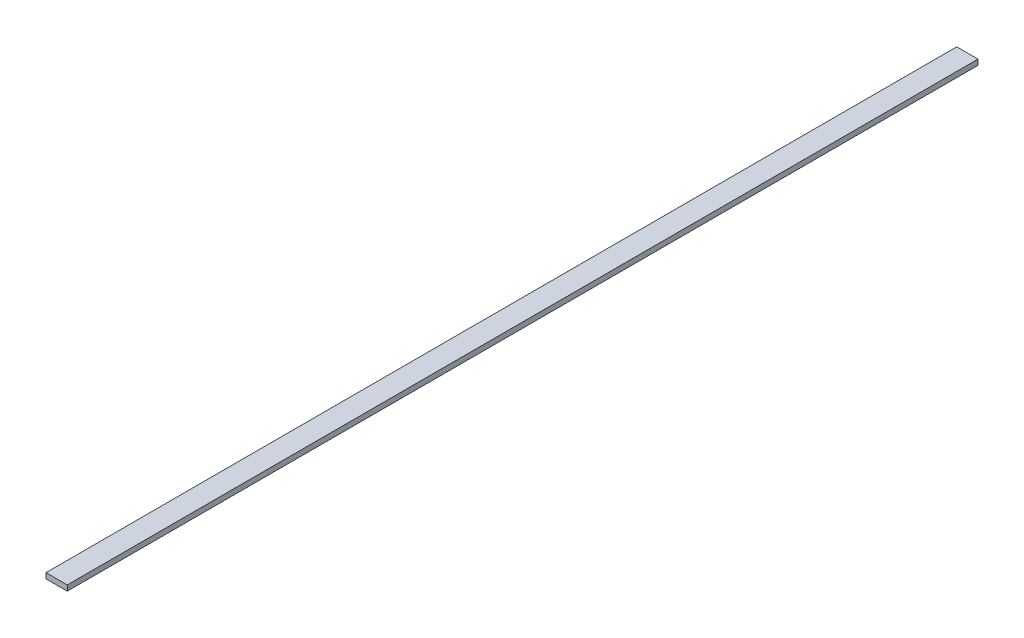
ISO-10303-21;
HEADER;
FILE_DESCRIPTION(('STEP AP214'),'2;1');
FILE_NAME('part.step','',(''),(''),'','','');
FILE_SCHEMA(('AUTOMOTIVE_DESIGN { 1 0 10303 214 1 1 1 1 }'));
ENDSEC;
DATA;
#1=APPLICATION_CONTEXT('core data for automotive mechanical design processes');
#2=APPLICATION_PROTOCOL_DEFINITION('international standard','automotive_design',2000,#1);
#3=PRODUCT_CONTEXT('',#1,'mechanical');
#4=PRODUCT('Part','Part','',(#3));
#5=PRODUCT_RELATED_PRODUCT_CATEGORY('part','',(#4));
#6=PRODUCT_DEFINITION_FORMATION('','',#4);
#7=PRODUCT_DEFINITION_CONTEXT('part definition',#1,'design');
#8=PRODUCT_DEFINITION('design','',#6,#7);
#9=PRODUCT_DEFINITION_SHAPE('','',#8);
#10=(LENGTH_UNIT() NAMED_UNIT(*) SI_UNIT(.MILLI.,.METRE.));
#11=(NAMED_UNIT(*) PLANE_ANGLE_UNIT() SI_UNIT($,.RADIAN.));
#12=(NAMED_UNIT(*) SI_UNIT($,.STERADIAN.) SOLID_ANGLE_UNIT());
#13=UNCERTAINTY_MEASURE_WITH_UNIT(LENGTH_MEASURE(1.E-05),#10,'distance_accuracy_value','');
#14=(GEOMETRIC_REPRESENTATION_CONTEXT(3) GLOBAL_UNCERTAINTY_ASSIGNED_CONTEXT((#13)) GLOBAL_UNIT_ASSIGNED_CONTEXT((#10,
#11,#12)) REPRESENTATION_CONTEXT('',''));
#15=CARTESIAN_POINT('',(0.,0.,0.));
#16=DIRECTION('',(0.,0.,1.));
#17=DIRECTION('',(1.,0.,0.));
#18=AXIS2_PLACEMENT_3D('',#15,#16,#17);
#19=CARTESIAN_POINT('',(0.,0.,925.));
#20=DIRECTION('',(1.,0.,0.));
#21=DIRECTION('',(0.,0.,-1.));
#22=AXIS2_PLACEMENT_3D('',#19,#20,#21);
#23=PLANE('',#22);
#24=DIRECTION('',(0.,-1.,0.));
#25=VECTOR('',#24,1.);
#26=CARTESIAN_POINT('',(0.,0.,0.));
#27=LINE('',#26,#25);
#28=CARTESIAN_POINT('',(0.,5.5,0.));
#29=VERTEX_POINT('',#28);
#30=CARTESIAN_POINT('',(0.,0.,0.));
#31=VERTEX_POINT('',#30);
#32=EDGE_CURVE('E100',#29,#31,#27,.T.);
#33=ORIENTED_EDGE('',*,*,#32,.T.);
#34=DIRECTION('',(0.,0.,-1.));
#35=VECTOR('',#34,1.);
#36=CARTESIAN_POINT('',(0.,0.,925.));
#37=LINE('',#36,#35);
#38=CARTESIAN_POINT('',(0.,0.,925.));
#39=VERTEX_POINT('',#38);
#40=EDGE_CURVE('E11',#39,#31,#37,.T.);
#41=ORIENTED_EDGE('',*,*,#40,.F.);
#42=DIRECTION('',(0.,-1.,0.));
#43=VECTOR('',#42,1.);
#44=CARTESIAN_POINT('',(0.,0.,925.));
#45=LINE('',#44,#43);
#46=CARTESIAN_POINT('',(0.,5.5,925.));
#47=VERTEX_POINT('',#46);
#48=EDGE_CURVE('E88',#47,#39,#45,.T.);
#49=ORIENTED_EDGE('',*,*,#48,.F.);
#50=DIRECTION('',(0.,0.,-1.));
#51=VECTOR('',#50,1.);
#52=CARTESIAN_POINT('',(0.,5.5,925.));
#53=LINE('',#52,#51);
#54=EDGE_CURVE('E96',#47,#29,#53,.T.);
#55=ORIENTED_EDGE('',*,*,#54,.T.);
#56=EDGE_LOOP('',(#33,#41,#49,#55));
#57=FACE_BOUND('',#56,.T.);
#58=ADVANCED_FACE('F37',(#57),#23,.F.);
#59=CARTESIAN_POINT('',(0.,0.,925.));
#60=DIRECTION('',(0.,1.,0.));
#61=DIRECTION('',(0.,0.,1.));
#62=AXIS2_PLACEMENT_3D('',#59,#60,#61);
#63=PLANE('',#62);
#64=DIRECTION('',(1.,0.,0.));
#65=VECTOR('',#64,1.);
#66=CARTESIAN_POINT('',(0.,0.,0.));
#67=LINE('',#66,#65);
#68=CARTESIAN_POINT('',(21.6,0.,0.));
#69=VERTEX_POINT('',#68);
#70=EDGE_CURVE('E92',#31,#69,#67,.T.);
#71=ORIENTED_EDGE('',*,*,#70,.T.);
#72=DIRECTION('',(0.,0.,-1.));
#73=VECTOR('',#72,1.);
#74=CARTESIAN_POINT('',(21.6,0.,925.));
#75=LINE('',#74,#73);
#76=CARTESIAN_POINT('',(21.6,0.,925.));
#77=VERTEX_POINT('',#76);
#78=EDGE_CURVE('E45',#77,#69,#75,.T.);
#79=ORIENTED_EDGE('',*,*,#78,.F.);
#80=DIRECTION('',(1.,0.,0.));
#81=VECTOR('',#80,1.);
#82=CARTESIAN_POINT('',(0.,0.,925.));
#83=LINE('',#82,#81);
#84=EDGE_CURVE('E83',#39,#77,#83,.T.);
#85=ORIENTED_EDGE('',*,*,#84,.F.);
#86=ORIENTED_EDGE('',*,*,#40,.T.);
#87=EDGE_LOOP('',(#71,#79,#85,#86));
#88=FACE_BOUND('',#87,.T.);
#89=ADVANCED_FACE('F91',(#88),#63,.F.);
#90=CARTESIAN_POINT('',(21.6,0.,925.));
#91=DIRECTION('',(-1.,0.,0.));
#92=DIRECTION('',(0.,0.,1.));
#93=AXIS2_PLACEMENT_3D('',#90,#91,#92);
#94=PLANE('',#93);
#95=DIRECTION('',(0.,1.,0.));
#96=VECTOR('',#95,1.);
#97=CARTESIAN_POINT('',(21.6,0.,0.));
#98=LINE('',#97,#96);
#99=CARTESIAN_POINT('',(21.6,5.5,0.));
#100=VERTEX_POINT('',#99);
#101=EDGE_CURVE('E70',#69,#100,#98,.T.);
#102=ORIENTED_EDGE('',*,*,#101,.T.);
#103=DIRECTION('',(0.,0.,-1.));
#104=VECTOR('',#103,1.);
#105=CARTESIAN_POINT('',(21.6,5.5,925.));
#106=LINE('',#105,#104);
#107=CARTESIAN_POINT('',(21.6,5.5,925.));
#108=VERTEX_POINT('',#107);
#109=EDGE_CURVE('E93',#108,#100,#106,.T.);
#110=ORIENTED_EDGE('',*,*,#109,.F.);
#111=DIRECTION('',(0.,1.,0.));
#112=VECTOR('',#111,1.);
#113=CARTESIAN_POINT('',(21.6,0.,925.));
#114=LINE('',#113,#112);
#115=EDGE_CURVE('E86',#77,#108,#114,.T.);
#116=ORIENTED_EDGE('',*,*,#115,.F.);
#117=ORIENTED_EDGE('',*,*,#78,.T.);
#118=EDGE_LOOP('',(#102,#110,#116,#117));
#119=FACE_BOUND('',#118,.T.);
#120=ADVANCED_FACE('F94',(#119),#94,.F.);
#121=CARTESIAN_POINT('',(0.,5.5,925.));
#122=DIRECTION('',(0.,-1.,0.));
#123=DIRECTION('',(0.,0.,-1.));
#124=AXIS2_PLACEMENT_3D('',#121,#122,#123);
#125=PLANE('',#124);
#126=DIRECTION('',(-1.,0.,0.));
#127=VECTOR('',#126,1.);
#128=CARTESIAN_POINT('',(0.,5.5,0.));
#129=LINE('',#128,#127);
#130=EDGE_CURVE('E76',#100,#29,#129,.T.);
#131=ORIENTED_EDGE('',*,*,#130,.T.);
#132=ORIENTED_EDGE('',*,*,#54,.F.);
#133=DIRECTION('',(-1.,0.,0.));
#134=VECTOR('',#133,1.);
#135=CARTESIAN_POINT('',(0.,5.5,925.));
#136=LINE('',#135,#134);
#137=EDGE_CURVE('E53',#108,#47,#136,.T.);
#138=ORIENTED_EDGE('',*,*,#137,.F.);
#139=ORIENTED_EDGE('',*,*,#109,.T.);
#140=EDGE_LOOP('',(#131,#132,#138,#139));
#141=FACE_BOUND('',#140,.T.);
#142=ADVANCED_FACE('F107',(#141),#125,.F.);
#143=CARTESIAN_POINT('',(0.,0.,925.));
#144=DIRECTION('',(0.,0.,-1.));
#145=DIRECTION('',(-1.,0.,0.));
#146=AXIS2_PLACEMENT_3D('',#143,#144,#145);
#147=PLANE('',#146);
#148=ORIENTED_EDGE('',*,*,#48,.T.);
#149=ORIENTED_EDGE('',*,*,#84,.T.);
#150=ORIENTED_EDGE('',*,*,#115,.T.);
#151=ORIENTED_EDGE('',*,*,#137,.T.);
#152=EDGE_LOOP('',(#148,#149,#150,#151));
#153=FACE_BOUND('',#152,.T.);
#154=ADVANCED_FACE('F84',(#153),#147,.F.);
#155=CARTESIAN_POINT('',(0.,0.,0.));
#156=DIRECTION('',(0.,0.,-1.));
#157=DIRECTION('',(-1.,0.,0.));
#158=AXIS2_PLACEMENT_3D('',#155,#156,#157);
#159=PLANE('',#158);
#160=ORIENTED_EDGE('',*,*,#32,.F.);
#161=ORIENTED_EDGE('',*,*,#130,.F.);
#162=ORIENTED_EDGE('',*,*,#101,.F.);
#163=ORIENTED_EDGE('',*,*,#70,.F.);
#164=EDGE_LOOP('',(#160,#161,#162,#163));
#165=FACE_BOUND('',#164,.T.);
#166=ADVANCED_FACE('F110',(#165),#159,.T.);
#167=CLOSED_SHELL('',(#58,#89,#120,#142,#154,#166));
#168=MANIFOLD_SOLID_BREP('B2',#167);
#169=ADVANCED_BREP_SHAPE_REPRESENTATION('',(#18,#168),#14);
#170=SHAPE_DEFINITION_REPRESENTATION(#9,#169);
ENDSEC;
END-ISO-10303-21;
